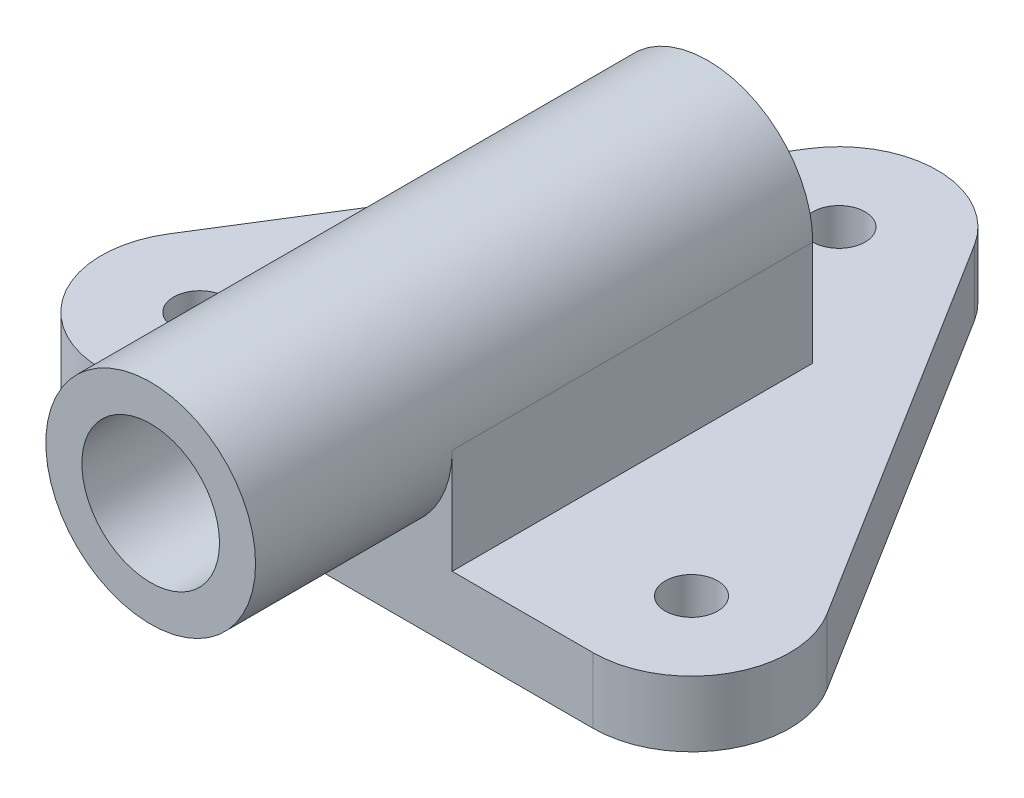
ISO-10303-21;
HEADER;
FILE_DESCRIPTION(('STEP AP214'),'2;1');
FILE_NAME('part.step','',(''),(''),'','','');
FILE_SCHEMA(('AUTOMOTIVE_DESIGN { 1 0 10303 214 1 1 1 1 }'));
ENDSEC;
DATA;
#1=APPLICATION_CONTEXT('core data for automotive mechanical design processes');
#2=APPLICATION_PROTOCOL_DEFINITION('international standard','automotive_design',2000,#1);
#3=PRODUCT_CONTEXT('',#1,'mechanical');
#4=PRODUCT('Part','Part','',(#3));
#5=PRODUCT_RELATED_PRODUCT_CATEGORY('part','',(#4));
#6=PRODUCT_DEFINITION_FORMATION('','',#4);
#7=PRODUCT_DEFINITION_CONTEXT('part definition',#1,'design');
#8=PRODUCT_DEFINITION('design','',#6,#7);
#9=PRODUCT_DEFINITION_SHAPE('','',#8);
#10=(LENGTH_UNIT() NAMED_UNIT(*) SI_UNIT(.MILLI.,.METRE.));
#11=(NAMED_UNIT(*) PLANE_ANGLE_UNIT() SI_UNIT($,.RADIAN.));
#12=(NAMED_UNIT(*) SI_UNIT($,.STERADIAN.) SOLID_ANGLE_UNIT());
#13=UNCERTAINTY_MEASURE_WITH_UNIT(LENGTH_MEASURE(1.E-05),#10,'distance_accuracy_value','');
#14=(GEOMETRIC_REPRESENTATION_CONTEXT(3) GLOBAL_UNCERTAINTY_ASSIGNED_CONTEXT((#13)) GLOBAL_UNIT_ASSIGNED_CONTEXT((#10,
#11,#12)) REPRESENTATION_CONTEXT('',''));
#15=CARTESIAN_POINT('',(0.,0.,0.));
#16=DIRECTION('',(0.,0.,1.));
#17=DIRECTION('',(1.,0.,0.));
#18=AXIS2_PLACEMENT_3D('',#15,#16,#17);
#19=CARTESIAN_POINT('',(-12.7199745600763,10.,-7.9499841000477));
#20=DIRECTION('',(0.847998304005088,0.,0.52999894000318));
#21=DIRECTION('',(0.52999894000318,0.,-0.847998304005088));
#22=AXIS2_PLACEMENT_3D('',#19,#20,#21);
#23=PLANE('',#22);
#24=DIRECTION('',(-0.52999894000318,0.,0.847998304005088));
#25=VECTOR('',#24,1.);
#26=CARTESIAN_POINT('',(-12.7199745600763,0.,-7.9499841000477));
#27=LINE('',#26,#25);
#28=CARTESIAN_POINT('',(-12.7199745600763,0.,-7.9499841000477));
#29=VERTEX_POINT('',#28);
#30=CARTESIAN_POINT('',(-50.2199745600763,0.,52.0500158999523));
#31=VERTEX_POINT('',#30);
#32=EDGE_CURVE('E194',#29,#31,#27,.T.);
#33=ORIENTED_EDGE('',*,*,#32,.T.);
#34=DIRECTION('',(0.,-1.,0.));
#35=VECTOR('',#34,1.);
#36=CARTESIAN_POINT('',(-50.2199745600763,10.,52.0500158999523));
#37=LINE('',#36,#35);
#38=CARTESIAN_POINT('',(-50.2199745600763,10.,52.0500158999523));
#39=VERTEX_POINT('',#38);
#40=EDGE_CURVE('E12',#39,#31,#37,.T.);
#41=ORIENTED_EDGE('',*,*,#40,.F.);
#42=DIRECTION('',(-0.52999894000318,0.,0.847998304005088));
#43=VECTOR('',#42,1.);
#44=CARTESIAN_POINT('',(-12.7199745600763,10.,-7.9499841000477));
#45=LINE('',#44,#43);
#46=CARTESIAN_POINT('',(-12.7199745600763,10.,-7.9499841000477));
#47=VERTEX_POINT('',#46);
#48=EDGE_CURVE('E169',#47,#39,#45,.T.);
#49=ORIENTED_EDGE('',*,*,#48,.F.);
#50=DIRECTION('',(0.,-1.,0.));
#51=VECTOR('',#50,1.);
#52=CARTESIAN_POINT('',(-12.7199745600763,10.,-7.9499841000477));
#53=LINE('',#52,#51);
#54=EDGE_CURVE('E193',#47,#29,#53,.T.);
#55=ORIENTED_EDGE('',*,*,#54,.T.);
#56=EDGE_LOOP('',(#33,#41,#49,#55));
#57=FACE_BOUND('',#56,.T.);
#58=ADVANCED_FACE('F63',(#57),#23,.F.);
#59=CARTESIAN_POINT('',(-37.5,10.,60.));
#60=DIRECTION('',(0.,-1.,0.));
#61=DIRECTION('',(0.,0.,-1.));
#62=AXIS2_PLACEMENT_3D('',#59,#60,#61);
#63=CYLINDRICAL_SURFACE('',#62,15.);
#64=CARTESIAN_POINT('',(-37.5,0.,60.));
#65=DIRECTION('',(0.,1.,0.));
#66=DIRECTION('',(0.,0.,1.));
#67=AXIS2_PLACEMENT_3D('',#64,#65,#66);
#68=CIRCLE('',#67,15.);
#69=CARTESIAN_POINT('',(-37.5,0.,75.));
#70=VERTEX_POINT('',#69);
#71=EDGE_CURVE('E198',#31,#70,#68,.T.);
#72=ORIENTED_EDGE('',*,*,#71,.T.);
#73=DIRECTION('',(0.,-1.,0.));
#74=VECTOR('',#73,1.);
#75=CARTESIAN_POINT('',(-37.5,10.,75.));
#76=LINE('',#75,#74);
#77=CARTESIAN_POINT('',(-37.5,10.,75.));
#78=VERTEX_POINT('',#77);
#79=EDGE_CURVE('E71',#78,#70,#76,.T.);
#80=ORIENTED_EDGE('',*,*,#79,.F.);
#81=CARTESIAN_POINT('',(-37.5,10.,60.));
#82=DIRECTION('',(0.,1.,0.));
#83=DIRECTION('',(0.,0.,1.));
#84=AXIS2_PLACEMENT_3D('',#81,#82,#83);
#85=CIRCLE('',#84,15.);
#86=EDGE_CURVE('E164',#39,#78,#85,.T.);
#87=ORIENTED_EDGE('',*,*,#86,.F.);
#88=ORIENTED_EDGE('',*,*,#40,.T.);
#89=EDGE_LOOP('',(#72,#80,#87,#88));
#90=FACE_BOUND('',#89,.T.);
#91=ADVANCED_FACE('F332',(#90),#63,.T.);
#92=CARTESIAN_POINT('',(0.,10.,75.));
#93=DIRECTION('',(0.,0.,-1.));
#94=DIRECTION('',(-1.,0.,0.));
#95=AXIS2_PLACEMENT_3D('',#92,#93,#94);
#96=PLANE('',#95);
#97=DIRECTION('',(1.,0.,0.));
#98=VECTOR('',#97,1.);
#99=CARTESIAN_POINT('',(0.,0.,75.));
#100=LINE('',#99,#98);
#101=CARTESIAN_POINT('',(37.5,0.,75.));
#102=VERTEX_POINT('',#101);
#103=EDGE_CURVE('E202',#70,#102,#100,.T.);
#104=ORIENTED_EDGE('',*,*,#103,.T.);
#105=DIRECTION('',(0.,-1.,0.));
#106=VECTOR('',#105,1.);
#107=CARTESIAN_POINT('',(37.5,10.,75.));
#108=LINE('',#107,#106);
#109=CARTESIAN_POINT('',(37.5,10.,75.));
#110=VERTEX_POINT('',#109);
#111=EDGE_CURVE('E161',#110,#102,#108,.T.);
#112=ORIENTED_EDGE('',*,*,#111,.F.);
#113=DIRECTION('',(1.,0.,0.));
#114=VECTOR('',#113,1.);
#115=CARTESIAN_POINT('',(0.,10.,75.));
#116=LINE('',#115,#114);
#117=CARTESIAN_POINT('',(16.,10.,75.));
#118=VERTEX_POINT('',#117);
#119=EDGE_CURVE('E155',#118,#110,#116,.T.);
#120=ORIENTED_EDGE('',*,*,#119,.F.);
#121=DIRECTION('',(0.,1.,0.));
#122=VECTOR('',#121,1.);
#123=CARTESIAN_POINT('',(16.,0.,75.));
#124=LINE('',#123,#122);
#125=CARTESIAN_POINT('',(16.,26.,75.));
#126=VERTEX_POINT('',#125);
#127=EDGE_CURVE('E141',#118,#126,#124,.T.);
#128=ORIENTED_EDGE('',*,*,#127,.T.);
#129=CARTESIAN_POINT('',(0.,26.,75.));
#130=DIRECTION('',(0.,0.,1.));
#131=DIRECTION('',(1.,0.,0.));
#132=AXIS2_PLACEMENT_3D('',#129,#130,#131);
#133=CIRCLE('',#132,16.);
#134=CARTESIAN_POINT('',(-16.,26.,75.));
#135=VERTEX_POINT('',#134);
#136=EDGE_CURVE('E151',#135,#126,#133,.T.);
#137=ORIENTED_EDGE('',*,*,#136,.F.);
#138=DIRECTION('',(0.,-1.,0.));
#139=VECTOR('',#138,1.);
#140=CARTESIAN_POINT('',(-16.,0.,75.));
#141=LINE('',#140,#139);
#142=CARTESIAN_POINT('',(-16.,10.,75.));
#143=VERTEX_POINT('',#142);
#144=EDGE_CURVE('E299',#135,#143,#141,.T.);
#145=ORIENTED_EDGE('',*,*,#144,.T.);
#146=EDGE_CURVE('E85',#78,#143,#116,.T.);
#147=ORIENTED_EDGE('',*,*,#146,.F.);
#148=ORIENTED_EDGE('',*,*,#79,.T.);
#149=EDGE_LOOP('',(#104,#112,#120,#128,#137,#145,#147,#148));
#150=FACE_BOUND('',#149,.T.);
#151=ADVANCED_FACE('F159',(#150),#96,.F.);
#152=CARTESIAN_POINT('',(37.5,10.,60.));
#153=DIRECTION('',(0.,-1.,0.));
#154=DIRECTION('',(0.,0.,-1.));
#155=AXIS2_PLACEMENT_3D('',#152,#153,#154);
#156=CYLINDRICAL_SURFACE('',#155,15.);
#157=CARTESIAN_POINT('',(37.5,0.,60.));
#158=DIRECTION('',(0.,1.,0.));
#159=DIRECTION('',(0.,0.,1.));
#160=AXIS2_PLACEMENT_3D('',#157,#158,#159);
#161=CIRCLE('',#160,15.);
#162=CARTESIAN_POINT('',(50.2199745600763,0.,52.0500158999523));
#163=VERTEX_POINT('',#162);
#164=EDGE_CURVE('E205',#102,#163,#161,.T.);
#165=ORIENTED_EDGE('',*,*,#164,.T.);
#166=DIRECTION('',(0.,-1.,0.));
#167=VECTOR('',#166,1.);
#168=CARTESIAN_POINT('',(50.2199745600763,10.,52.0500158999523));
#169=LINE('',#168,#167);
#170=CARTESIAN_POINT('',(50.2199745600763,10.,52.0500158999523));
#171=VERTEX_POINT('',#170);
#172=EDGE_CURVE('E233',#171,#163,#169,.T.);
#173=ORIENTED_EDGE('',*,*,#172,.F.);
#174=CARTESIAN_POINT('',(37.5,10.,60.));
#175=DIRECTION('',(0.,1.,0.));
#176=DIRECTION('',(0.,0.,1.));
#177=AXIS2_PLACEMENT_3D('',#174,#175,#176);
#178=CIRCLE('',#177,15.);
#179=EDGE_CURVE('E168',#110,#171,#178,.T.);
#180=ORIENTED_EDGE('',*,*,#179,.F.);
#181=ORIENTED_EDGE('',*,*,#111,.T.);
#182=EDGE_LOOP('',(#165,#173,#180,#181));
#183=FACE_BOUND('',#182,.T.);
#184=ADVANCED_FACE('F253',(#183),#156,.T.);
#185=CARTESIAN_POINT('',(12.7199745600763,10.,-7.94998410004771));
#186=DIRECTION('',(-0.847998304005088,0.,0.52999894000318));
#187=DIRECTION('',(0.52999894000318,0.,0.847998304005088));
#188=AXIS2_PLACEMENT_3D('',#185,#186,#187);
#189=PLANE('',#188);
#190=DIRECTION('',(-0.52999894000318,0.,-0.847998304005088));
#191=VECTOR('',#190,1.);
#192=CARTESIAN_POINT('',(12.7199745600763,0.,-7.94998410004771));
#193=LINE('',#192,#191);
#194=CARTESIAN_POINT('',(12.7199745600763,0.,-7.9499841000477));
#195=VERTEX_POINT('',#194);
#196=EDGE_CURVE('E208',#163,#195,#193,.T.);
#197=ORIENTED_EDGE('',*,*,#196,.T.);
#198=DIRECTION('',(0.,-1.,0.));
#199=VECTOR('',#198,1.);
#200=CARTESIAN_POINT('',(12.7199745600763,10.,-7.9499841000477));
#201=LINE('',#200,#199);
#202=CARTESIAN_POINT('',(12.7199745600763,10.,-7.9499841000477));
#203=VERTEX_POINT('',#202);
#204=EDGE_CURVE('E229',#203,#195,#201,.T.);
#205=ORIENTED_EDGE('',*,*,#204,.F.);
#206=DIRECTION('',(-0.52999894000318,0.,-0.847998304005088));
#207=VECTOR('',#206,1.);
#208=CARTESIAN_POINT('',(12.7199745600763,10.,-7.94998410004771));
#209=LINE('',#208,#207);
#210=EDGE_CURVE('E175',#171,#203,#209,.T.);
#211=ORIENTED_EDGE('',*,*,#210,.F.);
#212=ORIENTED_EDGE('',*,*,#172,.T.);
#213=EDGE_LOOP('',(#197,#205,#211,#212));
#214=FACE_BOUND('',#213,.T.);
#215=ADVANCED_FACE('F256',(#214),#189,.F.);
#216=CARTESIAN_POINT('',(37.5,10.,60.));
#217=DIRECTION('',(0.,-1.,0.));
#218=DIRECTION('',(0.,0.,-1.));
#219=AXIS2_PLACEMENT_3D('',#216,#217,#218);
#220=CYLINDRICAL_SURFACE('',#219,4.00000000000001);
#221=CARTESIAN_POINT('',(37.5,10.,60.));
#222=DIRECTION('',(0.,1.,0.));
#223=DIRECTION('',(0.,0.,1.));
#224=AXIS2_PLACEMENT_3D('',#221,#222,#223);
#225=CIRCLE('',#224,4.00000000000001);
#226=CARTESIAN_POINT('',(37.5,10.,64.));
#227=VERTEX_POINT('',#226);
#228=EDGE_CURVE('E185',#227,#227,#225,.T.);
#229=ORIENTED_EDGE('',*,*,#228,.T.);
#230=EDGE_LOOP('',(#229));
#231=FACE_BOUND('',#230,.T.);
#232=CARTESIAN_POINT('',(37.5,0.,60.));
#233=DIRECTION('',(0.,1.,0.));
#234=DIRECTION('',(0.,0.,1.));
#235=AXIS2_PLACEMENT_3D('',#232,#233,#234);
#236=CIRCLE('',#235,4.00000000000001);
#237=CARTESIAN_POINT('',(37.5,0.,64.));
#238=VERTEX_POINT('',#237);
#239=EDGE_CURVE('E218',#238,#238,#236,.T.);
#240=ORIENTED_EDGE('',*,*,#239,.F.);
#241=EDGE_LOOP('',(#240));
#242=FACE_BOUND('',#241,.T.);
#243=ADVANCED_FACE('F345',(#231,#242),#220,.F.);
#244=CARTESIAN_POINT('',(0.,10.,0.));
#245=DIRECTION('',(0.,-1.,0.));
#246=DIRECTION('',(0.,0.,-1.));
#247=AXIS2_PLACEMENT_3D('',#244,#245,#246);
#248=CYLINDRICAL_SURFACE('',#247,4.);
#249=CARTESIAN_POINT('',(0.,10.,0.));
#250=DIRECTION('',(0.,1.,0.));
#251=DIRECTION('',(0.,0.,1.));
#252=AXIS2_PLACEMENT_3D('',#249,#250,#251);
#253=CIRCLE('',#252,4.);
#254=CARTESIAN_POINT('',(0.,10.,4.));
#255=VERTEX_POINT('',#254);
#256=EDGE_CURVE('E181',#255,#255,#253,.T.);
#257=ORIENTED_EDGE('',*,*,#256,.T.);
#258=EDGE_LOOP('',(#257));
#259=FACE_BOUND('',#258,.T.);
#260=CARTESIAN_POINT('',(0.,0.,0.));
#261=DIRECTION('',(0.,1.,0.));
#262=DIRECTION('',(0.,0.,1.));
#263=AXIS2_PLACEMENT_3D('',#260,#261,#262);
#264=CIRCLE('',#263,4.);
#265=CARTESIAN_POINT('',(0.,0.,4.));
#266=VERTEX_POINT('',#265);
#267=EDGE_CURVE('E214',#266,#266,#264,.T.);
#268=ORIENTED_EDGE('',*,*,#267,.F.);
#269=EDGE_LOOP('',(#268));
#270=FACE_BOUND('',#269,.T.);
#271=ADVANCED_FACE('F349',(#259,#270),#248,.F.);
#272=CARTESIAN_POINT('',(0.,10.,0.));
#273=DIRECTION('',(0.,-1.,0.));
#274=DIRECTION('',(0.,0.,-1.));
#275=AXIS2_PLACEMENT_3D('',#272,#273,#274);
#276=CYLINDRICAL_SURFACE('',#275,15.);
#277=CARTESIAN_POINT('',(0.,0.,0.));
#278=DIRECTION('',(0.,1.,0.));
#279=DIRECTION('',(0.,0.,1.));
#280=AXIS2_PLACEMENT_3D('',#277,#278,#279);
#281=CIRCLE('',#280,15.);
#282=EDGE_CURVE('E211',#195,#29,#281,.T.);
#283=ORIENTED_EDGE('',*,*,#282,.T.);
#284=ORIENTED_EDGE('',*,*,#54,.F.);
#285=CARTESIAN_POINT('',(0.,10.,0.));
#286=DIRECTION('',(0.,1.,0.));
#287=DIRECTION('',(0.,0.,1.));
#288=AXIS2_PLACEMENT_3D('',#285,#286,#287);
#289=CIRCLE('',#288,15.);
#290=EDGE_CURVE('E178',#203,#47,#289,.T.);
#291=ORIENTED_EDGE('',*,*,#290,.F.);
#292=ORIENTED_EDGE('',*,*,#204,.T.);
#293=EDGE_LOOP('',(#283,#284,#291,#292));
#294=FACE_BOUND('',#293,.T.);
#295=ADVANCED_FACE('F264',(#294),#276,.T.);
#296=CARTESIAN_POINT('',(-37.5,10.,60.));
#297=DIRECTION('',(0.,-1.,0.));
#298=DIRECTION('',(0.,0.,-1.));
#299=AXIS2_PLACEMENT_3D('',#296,#297,#298);
#300=CYLINDRICAL_SURFACE('',#299,4.);
#301=CARTESIAN_POINT('',(-37.5,10.,60.));
#302=DIRECTION('',(0.,1.,0.));
#303=DIRECTION('',(0.,0.,1.));
#304=AXIS2_PLACEMENT_3D('',#301,#302,#303);
#305=CIRCLE('',#304,4.);
#306=CARTESIAN_POINT('',(-37.5,10.,64.));
#307=VERTEX_POINT('',#306);
#308=EDGE_CURVE('E189',#307,#307,#305,.T.);
#309=ORIENTED_EDGE('',*,*,#308,.T.);
#310=EDGE_LOOP('',(#309));
#311=FACE_BOUND('',#310,.T.);
#312=CARTESIAN_POINT('',(-37.5,0.,60.));
#313=DIRECTION('',(0.,1.,0.));
#314=DIRECTION('',(0.,0.,1.));
#315=AXIS2_PLACEMENT_3D('',#312,#313,#314);
#316=CIRCLE('',#315,4.);
#317=CARTESIAN_POINT('',(-37.5,0.,64.));
#318=VERTEX_POINT('',#317);
#319=EDGE_CURVE('E222',#318,#318,#316,.T.);
#320=ORIENTED_EDGE('',*,*,#319,.F.);
#321=EDGE_LOOP('',(#320));
#322=FACE_BOUND('',#321,.T.);
#323=ADVANCED_FACE('F348',(#311,#322),#300,.F.);
#324=CARTESIAN_POINT('',(0.,10.,0.));
#325=DIRECTION('',(0.,1.,0.));
#326=DIRECTION('',(0.,0.,1.));
#327=AXIS2_PLACEMENT_3D('',#324,#325,#326);
#328=PLANE('',#327);
#329=DIRECTION('',(0.,0.,1.));
#330=VECTOR('',#329,1.);
#331=CARTESIAN_POINT('',(-16.,10.,-2.62741699796952));
#332=LINE('',#331,#330);
#333=CARTESIAN_POINT('',(-16.,10.,20.));
#334=VERTEX_POINT('',#333);
#335=EDGE_CURVE('E294',#334,#143,#332,.T.);
#336=ORIENTED_EDGE('',*,*,#335,.F.);
#337=DIRECTION('',(1.,0.,0.));
#338=VECTOR('',#337,1.);
#339=CARTESIAN_POINT('',(0.,10.,20.));
#340=LINE('',#339,#338);
#341=CARTESIAN_POINT('',(16.,10.,20.));
#342=VERTEX_POINT('',#341);
#343=EDGE_CURVE('E78',#334,#342,#340,.T.);
#344=ORIENTED_EDGE('',*,*,#343,.T.);
#345=DIRECTION('',(0.,0.,1.));
#346=VECTOR('',#345,1.);
#347=CARTESIAN_POINT('',(16.,10.,-2.62741699796952));
#348=LINE('',#347,#346);
#349=EDGE_CURVE('E144',#342,#118,#348,.T.);
#350=ORIENTED_EDGE('',*,*,#349,.T.);
#351=ORIENTED_EDGE('',*,*,#119,.T.);
#352=ORIENTED_EDGE('',*,*,#179,.T.);
#353=ORIENTED_EDGE('',*,*,#210,.T.);
#354=ORIENTED_EDGE('',*,*,#290,.T.);
#355=ORIENTED_EDGE('',*,*,#48,.T.);
#356=ORIENTED_EDGE('',*,*,#86,.T.);
#357=ORIENTED_EDGE('',*,*,#146,.T.);
#358=EDGE_LOOP('',(#336,#344,#350,#351,#352,#353,#354,#355,#356,#357));
#359=FACE_BOUND('',#358,.T.);
#360=ORIENTED_EDGE('',*,*,#256,.F.);
#361=EDGE_LOOP('',(#360));
#362=FACE_BOUND('',#361,.T.);
#363=ORIENTED_EDGE('',*,*,#228,.F.);
#364=EDGE_LOOP('',(#363));
#365=FACE_BOUND('',#364,.T.);
#366=ORIENTED_EDGE('',*,*,#308,.F.);
#367=EDGE_LOOP('',(#366));
#368=FACE_BOUND('',#367,.T.);
#369=ADVANCED_FACE('F153',(#359,#362,#365,#368),#328,.T.);
#370=CARTESIAN_POINT('',(0.,0.,0.));
#371=DIRECTION('',(0.,1.,0.));
#372=DIRECTION('',(0.,0.,1.));
#373=AXIS2_PLACEMENT_3D('',#370,#371,#372);
#374=PLANE('',#373);
#375=ORIENTED_EDGE('',*,*,#32,.F.);
#376=ORIENTED_EDGE('',*,*,#282,.F.);
#377=ORIENTED_EDGE('',*,*,#196,.F.);
#378=ORIENTED_EDGE('',*,*,#164,.F.);
#379=ORIENTED_EDGE('',*,*,#103,.F.);
#380=ORIENTED_EDGE('',*,*,#71,.F.);
#381=EDGE_LOOP('',(#375,#376,#377,#378,#379,#380));
#382=FACE_BOUND('',#381,.T.);
#383=ORIENTED_EDGE('',*,*,#267,.T.);
#384=EDGE_LOOP('',(#383));
#385=FACE_BOUND('',#384,.T.);
#386=ORIENTED_EDGE('',*,*,#239,.T.);
#387=EDGE_LOOP('',(#386));
#388=FACE_BOUND('',#387,.T.);
#389=ORIENTED_EDGE('',*,*,#319,.T.);
#390=EDGE_LOOP('',(#389));
#391=FACE_BOUND('',#390,.T.);
#392=ADVANCED_FACE('F247',(#382,#385,#388,#391),#374,.F.);
#393=CARTESIAN_POINT('',(16.,0.,-2.62741699796952));
#394=DIRECTION('',(1.,0.,0.));
#395=DIRECTION('',(0.,0.,-1.));
#396=AXIS2_PLACEMENT_3D('',#393,#394,#395);
#397=PLANE('',#396);
#398=DIRECTION('',(0.,-1.,0.));
#399=VECTOR('',#398,1.);
#400=CARTESIAN_POINT('',(16.,0.,20.));
#401=LINE('',#400,#399);
#402=CARTESIAN_POINT('',(16.,26.,20.));
#403=VERTEX_POINT('',#402);
#404=EDGE_CURVE('E199',#403,#342,#401,.T.);
#405=ORIENTED_EDGE('',*,*,#404,.F.);
#406=DIRECTION('',(0.,0.,1.));
#407=VECTOR('',#406,1.);
#408=CARTESIAN_POINT('',(16.,26.,-2.62741699796952));
#409=LINE('',#408,#407);
#410=EDGE_CURVE('E146',#403,#126,#409,.T.);
#411=ORIENTED_EDGE('',*,*,#410,.T.);
#412=ORIENTED_EDGE('',*,*,#127,.F.);
#413=ORIENTED_EDGE('',*,*,#349,.F.);
#414=EDGE_LOOP('',(#405,#411,#412,#413));
#415=FACE_BOUND('',#414,.T.);
#416=ADVANCED_FACE('F143',(#415),#397,.T.);
#417=CARTESIAN_POINT('',(0.,26.,20.));
#418=DIRECTION('',(0.,0.,1.));
#419=DIRECTION('',(1.,0.,0.));
#420=AXIS2_PLACEMENT_3D('',#417,#418,#419);
#421=PLANE('',#420);
#422=ORIENTED_EDGE('',*,*,#404,.T.);
#423=ORIENTED_EDGE('',*,*,#343,.F.);
#424=DIRECTION('',(0.,1.,0.));
#425=VECTOR('',#424,1.);
#426=CARTESIAN_POINT('',(-16.,0.,20.));
#427=LINE('',#426,#425);
#428=CARTESIAN_POINT('',(-16.,26.,20.));
#429=VERTEX_POINT('',#428);
#430=EDGE_CURVE('E291',#334,#429,#427,.T.);
#431=ORIENTED_EDGE('',*,*,#430,.T.);
#432=CARTESIAN_POINT('',(0.,26.,20.));
#433=DIRECTION('',(0.,0.,1.));
#434=DIRECTION('',(1.,0.,0.));
#435=AXIS2_PLACEMENT_3D('',#432,#433,#434);
#436=CIRCLE('',#435,16.);
#437=EDGE_CURVE('E274',#403,#429,#436,.T.);
#438=ORIENTED_EDGE('',*,*,#437,.F.);
#439=EDGE_LOOP('',(#422,#423,#431,#438));
#440=FACE_BOUND('',#439,.T.);
#441=CARTESIAN_POINT('',(0.,26.,20.));
#442=DIRECTION('',(0.,0.,1.));
#443=DIRECTION('',(1.,0.,0.));
#444=AXIS2_PLACEMENT_3D('',#441,#442,#443);
#445=CIRCLE('',#444,10.5);
#446=CARTESIAN_POINT('',(10.5,26.,20.));
#447=VERTEX_POINT('',#446);
#448=EDGE_CURVE('E279',#447,#447,#445,.T.);
#449=ORIENTED_EDGE('',*,*,#448,.T.);
#450=EDGE_LOOP('',(#449));
#451=FACE_BOUND('',#450,.T.);
#452=ADVANCED_FACE('F309',(#440,#451),#421,.F.);
#453=CARTESIAN_POINT('',(0.,26.,20.));
#454=DIRECTION('',(0.,0.,1.));
#455=DIRECTION('',(1.,0.,0.));
#456=AXIS2_PLACEMENT_3D('',#453,#454,#455);
#457=CYLINDRICAL_SURFACE('',#456,16.);
#458=DIRECTION('',(0.,0.,1.));
#459=VECTOR('',#458,1.);
#460=CARTESIAN_POINT('',(-16.,26.,-2.62741699796952));
#461=LINE('',#460,#459);
#462=EDGE_CURVE('E295',#429,#135,#461,.T.);
#463=ORIENTED_EDGE('',*,*,#462,.T.);
#464=ORIENTED_EDGE('',*,*,#136,.T.);
#465=ORIENTED_EDGE('',*,*,#410,.F.);
#466=ORIENTED_EDGE('',*,*,#437,.T.);
#467=EDGE_LOOP('',(#463,#464,#465,#466));
#468=FACE_BOUND('',#467,.T.);
#469=CARTESIAN_POINT('',(0.,26.,105.));
#470=DIRECTION('',(0.,0.,1.));
#471=DIRECTION('',(1.,0.,0.));
#472=AXIS2_PLACEMENT_3D('',#469,#470,#471);
#473=CIRCLE('',#472,16.);
#474=CARTESIAN_POINT('',(16.,26.,105.));
#475=VERTEX_POINT('',#474);
#476=EDGE_CURVE('E283',#475,#475,#473,.T.);
#477=ORIENTED_EDGE('',*,*,#476,.F.);
#478=EDGE_LOOP('',(#477));
#479=FACE_BOUND('',#478,.T.);
#480=ADVANCED_FACE('F312',(#468,#479),#457,.T.);
#481=CARTESIAN_POINT('',(0.,26.,20.));
#482=DIRECTION('',(0.,0.,1.));
#483=DIRECTION('',(1.,0.,0.));
#484=AXIS2_PLACEMENT_3D('',#481,#482,#483);
#485=CYLINDRICAL_SURFACE('',#484,10.5);
#486=ORIENTED_EDGE('',*,*,#448,.F.);
#487=EDGE_LOOP('',(#486));
#488=FACE_BOUND('',#487,.T.);
#489=CARTESIAN_POINT('',(0.,26.,105.));
#490=DIRECTION('',(0.,0.,1.));
#491=DIRECTION('',(1.,0.,0.));
#492=AXIS2_PLACEMENT_3D('',#489,#490,#491);
#493=CIRCLE('',#492,10.5);
#494=CARTESIAN_POINT('',(10.5,26.,105.));
#495=VERTEX_POINT('',#494);
#496=EDGE_CURVE('E287',#495,#495,#493,.T.);
#497=ORIENTED_EDGE('',*,*,#496,.T.);
#498=EDGE_LOOP('',(#497));
#499=FACE_BOUND('',#498,.T.);
#500=ADVANCED_FACE('F315',(#488,#499),#485,.F.);
#501=CARTESIAN_POINT('',(0.,26.,105.));
#502=DIRECTION('',(0.,0.,1.));
#503=DIRECTION('',(1.,0.,0.));
#504=AXIS2_PLACEMENT_3D('',#501,#502,#503);
#505=PLANE('',#504);
#506=ORIENTED_EDGE('',*,*,#476,.T.);
#507=EDGE_LOOP('',(#506));
#508=FACE_BOUND('',#507,.T.);
#509=ORIENTED_EDGE('',*,*,#496,.F.);
#510=EDGE_LOOP('',(#509));
#511=FACE_BOUND('',#510,.T.);
#512=ADVANCED_FACE('F319',(#508,#511),#505,.T.);
#513=CARTESIAN_POINT('',(-16.,0.,-2.62741699796952));
#514=DIRECTION('',(-1.,0.,0.));
#515=DIRECTION('',(0.,0.,1.));
#516=AXIS2_PLACEMENT_3D('',#513,#514,#515);
#517=PLANE('',#516);
#518=ORIENTED_EDGE('',*,*,#430,.F.);
#519=ORIENTED_EDGE('',*,*,#335,.T.);
#520=ORIENTED_EDGE('',*,*,#144,.F.);
#521=ORIENTED_EDGE('',*,*,#462,.F.);
#522=EDGE_LOOP('',(#518,#519,#520,#521));
#523=FACE_BOUND('',#522,.T.);
#524=ADVANCED_FACE('F307',(#523),#517,.T.);
#525=CLOSED_SHELL('',(#58,#91,#151,#184,#215,#243,#271,#295,#323,#369,#392,#416,#452,#480,#500,
#512,#524));
#526=MANIFOLD_SOLID_BREP('B2',#525);
#527=ADVANCED_BREP_SHAPE_REPRESENTATION('',(#18,#526),#14);
#528=SHAPE_DEFINITION_REPRESENTATION(#9,#527);
ENDSEC;
END-ISO-10303-21;
